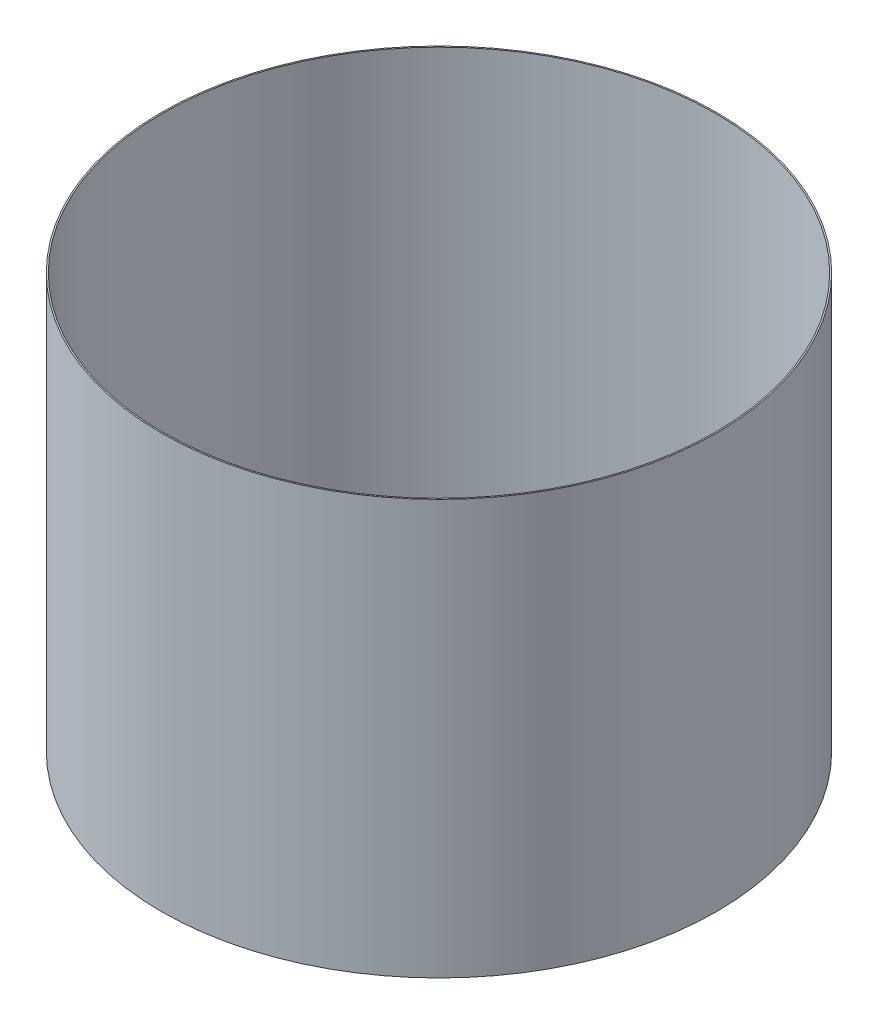
ISO-10303-21;
HEADER;
FILE_DESCRIPTION(('STEP AP214'),'2;1');
FILE_NAME('part.step','',(''),(''),'','','');
FILE_SCHEMA(('AUTOMOTIVE_DESIGN { 1 0 10303 214 1 1 1 1 }'));
ENDSEC;
DATA;
#1=APPLICATION_CONTEXT('core data for automotive mechanical design processes');
#2=APPLICATION_PROTOCOL_DEFINITION('international standard','automotive_design',2000,#1);
#3=PRODUCT_CONTEXT('',#1,'mechanical');
#4=PRODUCT('Part','Part','',(#3));
#5=PRODUCT_RELATED_PRODUCT_CATEGORY('part','',(#4));
#6=PRODUCT_DEFINITION_FORMATION('','',#4);
#7=PRODUCT_DEFINITION_CONTEXT('part definition',#1,'design');
#8=PRODUCT_DEFINITION('design','',#6,#7);
#9=PRODUCT_DEFINITION_SHAPE('','',#8);
#10=(LENGTH_UNIT() NAMED_UNIT(*) SI_UNIT(.MILLI.,.METRE.));
#11=(NAMED_UNIT(*) PLANE_ANGLE_UNIT() SI_UNIT($,.RADIAN.));
#12=(NAMED_UNIT(*) SI_UNIT($,.STERADIAN.) SOLID_ANGLE_UNIT());
#13=UNCERTAINTY_MEASURE_WITH_UNIT(LENGTH_MEASURE(1.E-05),#10,'distance_accuracy_value','');
#14=(GEOMETRIC_REPRESENTATION_CONTEXT(3) GLOBAL_UNCERTAINTY_ASSIGNED_CONTEXT((#13)) GLOBAL_UNIT_ASSIGNED_CONTEXT((#10,
#11,#12)) REPRESENTATION_CONTEXT('',''));
#15=CARTESIAN_POINT('',(0.,0.,0.));
#16=DIRECTION('',(0.,0.,1.));
#17=DIRECTION('',(1.,0.,0.));
#18=AXIS2_PLACEMENT_3D('',#15,#16,#17);
#19=CARTESIAN_POINT('',(0.,3000.,0.));
#20=DIRECTION('',(0.,1.,0.));
#21=DIRECTION('',(0.,0.,1.));
#22=AXIS2_PLACEMENT_3D('',#19,#20,#21);
#23=PLANE('',#22);
#24=CARTESIAN_POINT('',(0.,3000.,0.));
#25=DIRECTION('',(0.,1.,0.));
#26=DIRECTION('',(0.,0.,1.));
#27=AXIS2_PLACEMENT_3D('',#24,#25,#26);
#28=CIRCLE('',#27,2010.);
#29=CARTESIAN_POINT('',(0.,3000.,2010.));
#30=VERTEX_POINT('',#29);
#31=EDGE_CURVE('E10',#30,#30,#28,.T.);
#32=ORIENTED_EDGE('',*,*,#31,.T.);
#33=EDGE_LOOP('',(#32));
#34=FACE_BOUND('',#33,.T.);
#35=CARTESIAN_POINT('',(0.,3000.,0.));
#36=DIRECTION('',(0.,1.,0.));
#37=DIRECTION('',(0.,0.,1.));
#38=AXIS2_PLACEMENT_3D('',#35,#36,#37);
#39=CIRCLE('',#38,2000.);
#40=CARTESIAN_POINT('',(0.,3000.,2000.));
#41=VERTEX_POINT('',#40);
#42=EDGE_CURVE('E40',#41,#41,#39,.T.);
#43=ORIENTED_EDGE('',*,*,#42,.F.);
#44=EDGE_LOOP('',(#43));
#45=FACE_BOUND('',#44,.T.);
#46=ADVANCED_FACE('F29',(#34,#45),#23,.T.);
#47=CARTESIAN_POINT('',(0.,0.,0.));
#48=DIRECTION('',(0.,1.,0.));
#49=DIRECTION('',(0.,0.,1.));
#50=AXIS2_PLACEMENT_3D('',#47,#48,#49);
#51=PLANE('',#50);
#52=CARTESIAN_POINT('',(0.,0.,0.));
#53=DIRECTION('',(0.,1.,0.));
#54=DIRECTION('',(0.,0.,1.));
#55=AXIS2_PLACEMENT_3D('',#52,#53,#54);
#56=CIRCLE('',#55,2010.);
#57=CARTESIAN_POINT('',(0.,0.,2010.));
#58=VERTEX_POINT('',#57);
#59=EDGE_CURVE('E36',#58,#58,#56,.T.);
#60=ORIENTED_EDGE('',*,*,#59,.F.);
#61=EDGE_LOOP('',(#60));
#62=FACE_BOUND('',#61,.T.);
#63=CARTESIAN_POINT('',(0.,0.,0.));
#64=DIRECTION('',(0.,1.,0.));
#65=DIRECTION('',(0.,0.,1.));
#66=AXIS2_PLACEMENT_3D('',#63,#64,#65);
#67=CIRCLE('',#66,2000.);
#68=CARTESIAN_POINT('',(0.,0.,2000.));
#69=VERTEX_POINT('',#68);
#70=EDGE_CURVE('E44',#69,#69,#67,.T.);
#71=ORIENTED_EDGE('',*,*,#70,.T.);
#72=EDGE_LOOP('',(#71));
#73=FACE_BOUND('',#72,.T.);
#74=ADVANCED_FACE('F50',(#62,#73),#51,.F.);
#75=CARTESIAN_POINT('',(0.,3000.,0.));
#76=DIRECTION('',(0.,-1.,0.));
#77=DIRECTION('',(0.,0.,-1.));
#78=AXIS2_PLACEMENT_3D('',#75,#76,#77);
#79=CYLINDRICAL_SURFACE('',#78,2010.);
#80=ORIENTED_EDGE('',*,*,#31,.F.);
#81=EDGE_LOOP('',(#80));
#82=FACE_BOUND('',#81,.T.);
#83=ORIENTED_EDGE('',*,*,#59,.T.);
#84=EDGE_LOOP('',(#83));
#85=FACE_BOUND('',#84,.T.);
#86=ADVANCED_FACE('F31',(#82,#85),#79,.T.);
#87=CARTESIAN_POINT('',(0.,3000.,0.));
#88=DIRECTION('',(0.,-1.,0.));
#89=DIRECTION('',(0.,0.,-1.));
#90=AXIS2_PLACEMENT_3D('',#87,#88,#89);
#91=CYLINDRICAL_SURFACE('',#90,2000.);
#92=ORIENTED_EDGE('',*,*,#42,.T.);
#93=EDGE_LOOP('',(#92));
#94=FACE_BOUND('',#93,.T.);
#95=ORIENTED_EDGE('',*,*,#70,.F.);
#96=EDGE_LOOP('',(#95));
#97=FACE_BOUND('',#96,.T.);
#98=ADVANCED_FACE('F52',(#94,#97),#91,.F.);
#99=CLOSED_SHELL('',(#46,#74,#86,#98));
#100=MANIFOLD_SOLID_BREP('B2',#99);
#101=ADVANCED_BREP_SHAPE_REPRESENTATION('',(#18,#100),#14);
#102=SHAPE_DEFINITION_REPRESENTATION(#9,#101);
ENDSEC;
END-ISO-10303-21;
